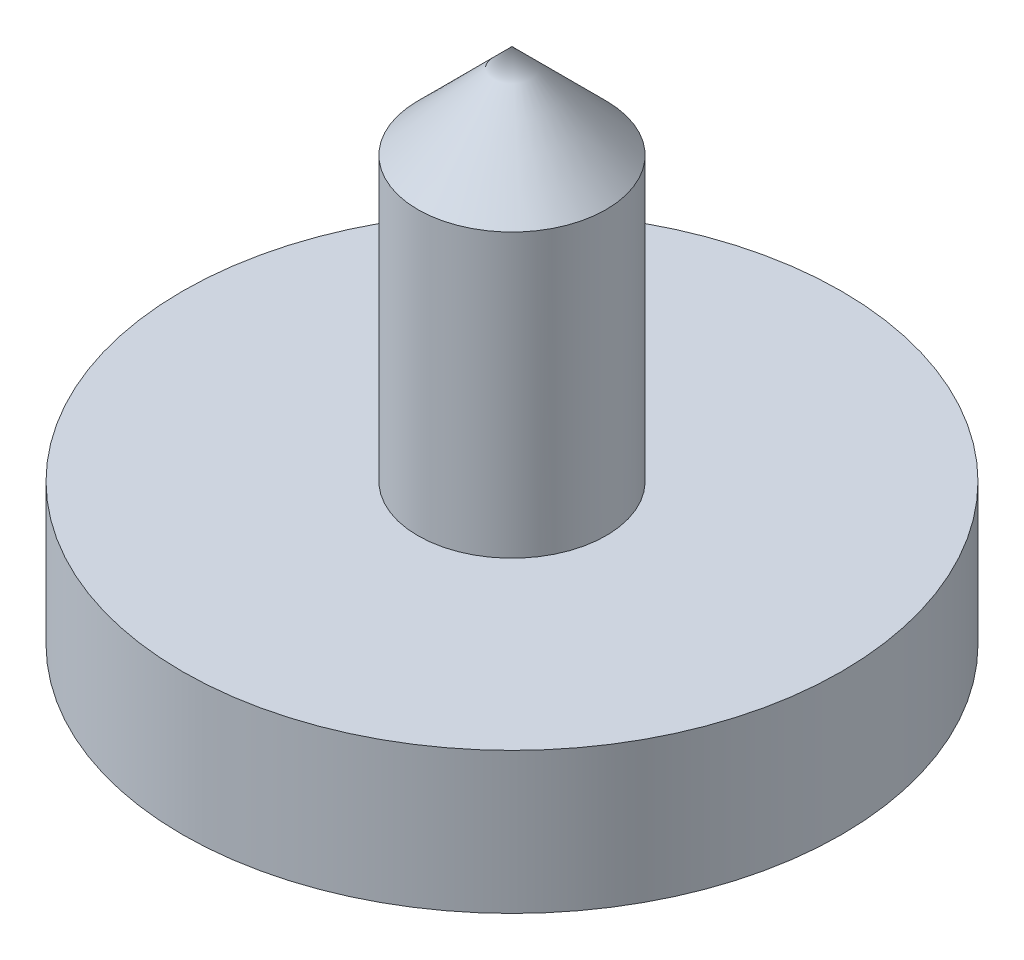
ISO-10303-21;
HEADER;
FILE_DESCRIPTION(('STEP AP214'),'2;1');
FILE_NAME('part.step','',(''),(''),'','','');
FILE_SCHEMA(('AUTOMOTIVE_DESIGN { 1 0 10303 214 1 1 1 1 }'));
ENDSEC;
DATA;
#1=APPLICATION_CONTEXT('core data for automotive mechanical design processes');
#2=APPLICATION_PROTOCOL_DEFINITION('international standard','automotive_design',2000,#1);
#3=PRODUCT_CONTEXT('',#1,'mechanical');
#4=PRODUCT('Part','Part','',(#3));
#5=PRODUCT_RELATED_PRODUCT_CATEGORY('part','',(#4));
#6=PRODUCT_DEFINITION_FORMATION('','',#4);
#7=PRODUCT_DEFINITION_CONTEXT('part definition',#1,'design');
#8=PRODUCT_DEFINITION('design','',#6,#7);
#9=PRODUCT_DEFINITION_SHAPE('','',#8);
#10=(LENGTH_UNIT() NAMED_UNIT(*) SI_UNIT(.MILLI.,.METRE.));
#11=(NAMED_UNIT(*) PLANE_ANGLE_UNIT() SI_UNIT($,.RADIAN.));
#12=(NAMED_UNIT(*) SI_UNIT($,.STERADIAN.) SOLID_ANGLE_UNIT());
#13=UNCERTAINTY_MEASURE_WITH_UNIT(LENGTH_MEASURE(1.E-05),#10,'distance_accuracy_value','');
#14=(GEOMETRIC_REPRESENTATION_CONTEXT(3) GLOBAL_UNCERTAINTY_ASSIGNED_CONTEXT((#13)) GLOBAL_UNIT_ASSIGNED_CONTEXT((#10,
#11,#12)) REPRESENTATION_CONTEXT('',''));
#15=CARTESIAN_POINT('',(0.,0.,0.));
#16=DIRECTION('',(0.,0.,1.));
#17=DIRECTION('',(1.,0.,0.));
#18=AXIS2_PLACEMENT_3D('',#15,#16,#17);
#19=CARTESIAN_POINT('',(0.,-1.,0.));
#20=DIRECTION('',(0.,1.,0.));
#21=DIRECTION('',(0.,0.,1.));
#22=AXIS2_PLACEMENT_3D('',#19,#20,#21);
#23=CYLINDRICAL_SURFACE('',#22,3.5);
#24=CARTESIAN_POINT('',(0.,-1.,0.));
#25=DIRECTION('',(0.,1.,0.));
#26=DIRECTION('',(0.,0.,1.));
#27=AXIS2_PLACEMENT_3D('',#24,#25,#26);
#28=CIRCLE('',#27,3.5);
#29=CARTESIAN_POINT('',(0.,-1.,3.5));
#30=VERTEX_POINT('',#29);
#31=EDGE_CURVE('E83',#30,#30,#28,.T.);
#32=ORIENTED_EDGE('',*,*,#31,.T.);
#33=EDGE_LOOP('',(#32));
#34=FACE_BOUND('',#33,.T.);
#35=CARTESIAN_POINT('',(0.,0.5,0.));
#36=DIRECTION('',(0.,1.,0.));
#37=DIRECTION('',(0.,0.,1.));
#38=AXIS2_PLACEMENT_3D('',#35,#36,#37);
#39=CIRCLE('',#38,3.5);
#40=CARTESIAN_POINT('',(0.,0.5,3.5));
#41=VERTEX_POINT('',#40);
#42=EDGE_CURVE('E84',#41,#41,#39,.T.);
#43=ORIENTED_EDGE('',*,*,#42,.F.);
#44=EDGE_LOOP('',(#43));
#45=FACE_BOUND('',#44,.T.);
#46=ADVANCED_FACE('F42',(#34,#45),#23,.T.);
#47=CARTESIAN_POINT('',(0.,0.5,0.));
#48=DIRECTION('',(0.,1.,0.));
#49=DIRECTION('',(0.,0.,1.));
#50=AXIS2_PLACEMENT_3D('',#47,#48,#49);
#51=PLANE('',#50);
#52=CARTESIAN_POINT('',(0.,0.5,0.));
#53=DIRECTION('',(0.,1.,0.));
#54=DIRECTION('',(0.,0.,1.));
#55=AXIS2_PLACEMENT_3D('',#52,#53,#54);
#56=CIRCLE('',#55,1.);
#57=CARTESIAN_POINT('',(0.,0.5,1.));
#58=VERTEX_POINT('',#57);
#59=EDGE_CURVE('E52',#58,#58,#56,.T.);
#60=ORIENTED_EDGE('',*,*,#59,.F.);
#61=EDGE_LOOP('',(#60));
#62=FACE_BOUND('',#61,.T.);
#63=ORIENTED_EDGE('',*,*,#42,.T.);
#64=EDGE_LOOP('',(#63));
#65=FACE_BOUND('',#64,.T.);
#66=ADVANCED_FACE('F68',(#62,#65),#51,.T.);
#67=CARTESIAN_POINT('',(0.,0.,0.));
#68=DIRECTION('',(0.,-1.,0.));
#69=DIRECTION('',(0.,0.,-1.));
#70=AXIS2_PLACEMENT_3D('',#67,#68,#69);
#71=CONICAL_SURFACE('',#70,0.,1.29249666778979);
#72=ORIENTED_EDGE('',*,*,#31,.F.);
#73=EDGE_LOOP('',(#72));
#74=FACE_BOUND('',#73,.T.);
#75=CARTESIAN_POINT('',(0.,0.,0.));
#76=VERTEX_POINT('',#75);
#77=VERTEX_LOOP('',#76);
#78=FACE_BOUND('',#77,.T.);
#79=ADVANCED_FACE('F63',(#74,#78),#71,.F.);
#80=CARTESIAN_POINT('',(0.,4.5,0.));
#81=DIRECTION('',(0.,-1.,0.));
#82=DIRECTION('',(0.,0.,-1.));
#83=AXIS2_PLACEMENT_3D('',#80,#81,#82);
#84=CYLINDRICAL_SURFACE('',#83,1.);
#85=CARTESIAN_POINT('',(0.,3.5,0.));
#86=DIRECTION('',(0.,1.,0.));
#87=DIRECTION('',(0.,0.,1.));
#88=AXIS2_PLACEMENT_3D('',#85,#86,#87);
#89=CIRCLE('',#88,1.);
#90=CARTESIAN_POINT('',(0.,3.5,1.));
#91=VERTEX_POINT('',#90);
#92=EDGE_CURVE('E12',#91,#91,#89,.F.);
#93=ORIENTED_EDGE('',*,*,#92,.T.);
#94=EDGE_LOOP('',(#93));
#95=FACE_BOUND('',#94,.T.);
#96=ORIENTED_EDGE('',*,*,#59,.T.);
#97=EDGE_LOOP('',(#96));
#98=FACE_BOUND('',#97,.T.);
#99=ADVANCED_FACE('F58',(#95,#98),#84,.T.);
#100=CARTESIAN_POINT('',(0.,3.5,0.));
#101=DIRECTION('',(0.,-1.,0.));
#102=DIRECTION('',(0.,0.,-1.));
#103=AXIS2_PLACEMENT_3D('',#100,#101,#102);
#104=CONICAL_SURFACE('',#103,0.999999999999998,0.785398163397447);
#105=ORIENTED_EDGE('',*,*,#92,.F.);
#106=EDGE_LOOP('',(#105));
#107=FACE_BOUND('',#106,.T.);
#108=CARTESIAN_POINT('',(0.,4.5,0.));
#109=VERTEX_POINT('',#108);
#110=VERTEX_LOOP('',#109);
#111=FACE_BOUND('',#110,.T.);
#112=ADVANCED_FACE('F45',(#107,#111),#104,.T.);
#113=CLOSED_SHELL('',(#46,#66,#79,#99,#112));
#114=MANIFOLD_SOLID_BREP('B2',#113);
#115=ADVANCED_BREP_SHAPE_REPRESENTATION('',(#18,#114),#14);
#116=SHAPE_DEFINITION_REPRESENTATION(#9,#115);
ENDSEC;
END-ISO-10303-21;
